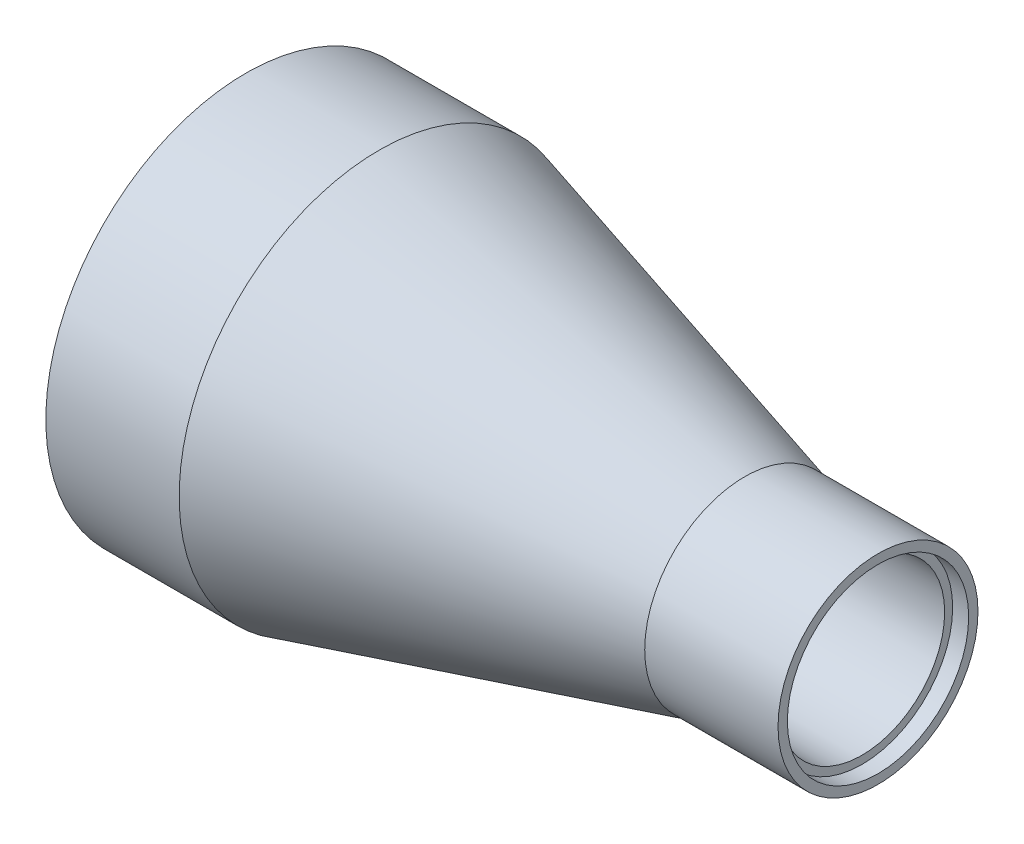
ISO-10303-21;
HEADER;
FILE_DESCRIPTION(('STEP AP214'),'2;1');
FILE_NAME('part.step','',(''),(''),'','','');
FILE_SCHEMA(('AUTOMOTIVE_DESIGN { 1 0 10303 214 1 1 1 1 }'));
ENDSEC;
DATA;
#1=APPLICATION_CONTEXT('core data for automotive mechanical design processes');
#2=APPLICATION_PROTOCOL_DEFINITION('international standard','automotive_design',2000,#1);
#3=PRODUCT_CONTEXT('',#1,'mechanical');
#4=PRODUCT('Part','Part','',(#3));
#5=PRODUCT_RELATED_PRODUCT_CATEGORY('part','',(#4));
#6=PRODUCT_DEFINITION_FORMATION('','',#4);
#7=PRODUCT_DEFINITION_CONTEXT('part definition',#1,'design');
#8=PRODUCT_DEFINITION('design','',#6,#7);
#9=PRODUCT_DEFINITION_SHAPE('','',#8);
#10=(LENGTH_UNIT() NAMED_UNIT(*) SI_UNIT(.MILLI.,.METRE.));
#11=(NAMED_UNIT(*) PLANE_ANGLE_UNIT() SI_UNIT($,.RADIAN.));
#12=(NAMED_UNIT(*) SI_UNIT($,.STERADIAN.) SOLID_ANGLE_UNIT());
#13=UNCERTAINTY_MEASURE_WITH_UNIT(LENGTH_MEASURE(1.E-05),#10,'distance_accuracy_value','');
#14=(GEOMETRIC_REPRESENTATION_CONTEXT(3) GLOBAL_UNCERTAINTY_ASSIGNED_CONTEXT((#13)) GLOBAL_UNIT_ASSIGNED_CONTEXT((#10,
#11,#12)) REPRESENTATION_CONTEXT('',''));
#15=CARTESIAN_POINT('',(0.,0.,0.));
#16=DIRECTION('',(0.,0.,1.));
#17=DIRECTION('',(1.,0.,0.));
#18=AXIS2_PLACEMENT_3D('',#15,#16,#17);
#19=CARTESIAN_POINT('',(0.,0.,0.));
#20=DIRECTION('',(1.,0.,0.));
#21=DIRECTION('',(0.,0.,-1.));
#22=AXIS2_PLACEMENT_3D('',#19,#20,#21);
#23=CYLINDRICAL_SURFACE('',#22,17.399);
#24=CARTESIAN_POINT('',(12.4782789957329,0.,0.));
#25=DIRECTION('',(1.,0.,0.));
#26=DIRECTION('',(0.,0.,-1.));
#27=AXIS2_PLACEMENT_3D('',#24,#25,#26);
#28=CIRCLE('',#27,17.399);
#29=CARTESIAN_POINT('',(12.4782789957329,0.,-17.399));
#30=VERTEX_POINT('',#29);
#31=EDGE_CURVE('E12',#30,#30,#28,.T.);
#32=ORIENTED_EDGE('',*,*,#31,.T.);
#33=EDGE_LOOP('',(#32));
#34=FACE_BOUND('',#33,.T.);
#35=CARTESIAN_POINT('',(0.,0.,0.));
#36=DIRECTION('',(1.,0.,0.));
#37=DIRECTION('',(0.,0.,-1.));
#38=AXIS2_PLACEMENT_3D('',#35,#36,#37);
#39=CIRCLE('',#38,17.399);
#40=CARTESIAN_POINT('',(0.,0.,-17.399));
#41=VERTEX_POINT('',#40);
#42=EDGE_CURVE('E80',#41,#41,#39,.T.);
#43=ORIENTED_EDGE('',*,*,#42,.F.);
#44=EDGE_LOOP('',(#43));
#45=FACE_BOUND('',#44,.T.);
#46=ADVANCED_FACE('F46',(#34,#45),#23,.F.);
#47=CARTESIAN_POINT('',(12.4782789957329,0.,0.));
#48=DIRECTION('',(-1.,0.,0.));
#49=DIRECTION('',(0.,0.,1.));
#50=AXIS2_PLACEMENT_3D('',#47,#48,#49);
#51=CONICAL_SURFACE('',#50,17.399,0.266992515356942);
#52=CARTESIAN_POINT('',(47.3016789971863,0.,0.));
#53=DIRECTION('',(1.,0.,0.));
#54=DIRECTION('',(0.,0.,-1.));
#55=AXIS2_PLACEMENT_3D('',#52,#53,#54);
#56=CIRCLE('',#55,7.87400000531202);
#57=CARTESIAN_POINT('',(47.3016789971863,0.,-7.87400000531202));
#58=VERTEX_POINT('',#57);
#59=EDGE_CURVE('E52',#58,#58,#56,.T.);
#60=ORIENTED_EDGE('',*,*,#59,.T.);
#61=EDGE_LOOP('',(#60));
#62=FACE_BOUND('',#61,.T.);
#63=ORIENTED_EDGE('',*,*,#31,.F.);
#64=EDGE_LOOP('',(#63));
#65=FACE_BOUND('',#64,.T.);
#66=ADVANCED_FACE('F88',(#62,#65),#51,.F.);
#67=CARTESIAN_POINT('',(0.,0.,0.));
#68=DIRECTION('',(1.,0.,0.));
#69=DIRECTION('',(0.,0.,-1.));
#70=AXIS2_PLACEMENT_3D('',#67,#68,#69);
#71=CYLINDRICAL_SURFACE('',#70,7.87400000531202);
#72=CARTESIAN_POINT('',(58.6994000000003,0.,0.));
#73=DIRECTION('',(1.,0.,0.));
#74=DIRECTION('',(0.,0.,-1.));
#75=AXIS2_PLACEMENT_3D('',#72,#73,#74);
#76=CIRCLE('',#75,7.87400000531202);
#77=CARTESIAN_POINT('',(58.6994000000003,0.,-7.87400000531202));
#78=VERTEX_POINT('',#77);
#79=EDGE_CURVE('E56',#78,#78,#76,.T.);
#80=ORIENTED_EDGE('',*,*,#79,.T.);
#81=EDGE_LOOP('',(#80));
#82=FACE_BOUND('',#81,.T.);
#83=ORIENTED_EDGE('',*,*,#59,.F.);
#84=EDGE_LOOP('',(#83));
#85=FACE_BOUND('',#84,.T.);
#86=ADVANCED_FACE('F93',(#82,#85),#71,.F.);
#87=CARTESIAN_POINT('',(58.6994000000003,7.87400000531202,0.));
#88=DIRECTION('',(1.,0.,0.));
#89=DIRECTION('',(0.,0.,-1.));
#90=AXIS2_PLACEMENT_3D('',#87,#88,#89);
#91=PLANE('',#90);
#92=CARTESIAN_POINT('',(58.6994000000003,0.,0.));
#93=DIRECTION('',(1.,0.,0.));
#94=DIRECTION('',(0.,0.,-1.));
#95=AXIS2_PLACEMENT_3D('',#92,#93,#94);
#96=CIRCLE('',#95,8.636000005312);
#97=CARTESIAN_POINT('',(58.6994000000003,0.,-8.636000005312));
#98=VERTEX_POINT('',#97);
#99=EDGE_CURVE('E60',#98,#98,#96,.T.);
#100=ORIENTED_EDGE('',*,*,#99,.T.);
#101=EDGE_LOOP('',(#100));
#102=FACE_BOUND('',#101,.T.);
#103=ORIENTED_EDGE('',*,*,#79,.F.);
#104=EDGE_LOOP('',(#103));
#105=FACE_BOUND('',#104,.T.);
#106=ADVANCED_FACE('F98',(#102,#105),#91,.T.);
#107=CARTESIAN_POINT('',(0.,0.,0.));
#108=DIRECTION('',(1.,0.,0.));
#109=DIRECTION('',(0.,0.,-1.));
#110=AXIS2_PLACEMENT_3D('',#107,#108,#109);
#111=CYLINDRICAL_SURFACE('',#110,8.636000005312);
#112=CARTESIAN_POINT('',(60.2234000000005,0.,0.));
#113=DIRECTION('',(1.,0.,0.));
#114=DIRECTION('',(0.,0.,-1.));
#115=AXIS2_PLACEMENT_3D('',#112,#113,#114);
#116=CIRCLE('',#115,8.636000005312);
#117=CARTESIAN_POINT('',(60.2234000000005,0.,-8.636000005312));
#118=VERTEX_POINT('',#117);
#119=EDGE_CURVE('E65',#118,#118,#116,.T.);
#120=ORIENTED_EDGE('',*,*,#119,.T.);
#121=EDGE_LOOP('',(#120));
#122=FACE_BOUND('',#121,.T.);
#123=ORIENTED_EDGE('',*,*,#99,.F.);
#124=EDGE_LOOP('',(#123));
#125=FACE_BOUND('',#124,.T.);
#126=ADVANCED_FACE('F105',(#122,#125),#111,.F.);
#127=CARTESIAN_POINT('',(60.2234000000005,8.636000005312,0.));
#128=DIRECTION('',(1.,0.,0.));
#129=DIRECTION('',(0.,0.,-1.));
#130=AXIS2_PLACEMENT_3D('',#127,#128,#129);
#131=PLANE('',#130);
#132=CARTESIAN_POINT('',(60.2234000000005,0.,0.));
#133=DIRECTION('',(1.,0.,0.));
#134=DIRECTION('',(0.,0.,-1.));
#135=AXIS2_PLACEMENT_3D('',#132,#133,#134);
#136=CIRCLE('',#135,9.52500001062405);
#137=CARTESIAN_POINT('',(60.2234000000005,0.,-9.52500001062405));
#138=VERTEX_POINT('',#137);
#139=EDGE_CURVE('E68',#138,#138,#136,.T.);
#140=ORIENTED_EDGE('',*,*,#139,.T.);
#141=EDGE_LOOP('',(#140));
#142=FACE_BOUND('',#141,.T.);
#143=ORIENTED_EDGE('',*,*,#119,.F.);
#144=EDGE_LOOP('',(#143));
#145=FACE_BOUND('',#144,.T.);
#146=ADVANCED_FACE('F109',(#142,#145),#131,.T.);
#147=CARTESIAN_POINT('',(0.,0.,0.));
#148=DIRECTION('',(1.,0.,0.));
#149=DIRECTION('',(0.,0.,-1.));
#150=AXIS2_PLACEMENT_3D('',#147,#148,#149);
#151=CYLINDRICAL_SURFACE('',#150,9.52500001062405);
#152=CARTESIAN_POINT('',(47.5234000014534,0.,0.));
#153=DIRECTION('',(1.,0.,0.));
#154=DIRECTION('',(0.,0.,-1.));
#155=AXIS2_PLACEMENT_3D('',#152,#153,#154);
#156=CIRCLE('',#155,9.52500001062405);
#157=CARTESIAN_POINT('',(47.5234000014534,0.,-9.52500001062405));
#158=VERTEX_POINT('',#157);
#159=EDGE_CURVE('E71',#158,#158,#156,.T.);
#160=ORIENTED_EDGE('',*,*,#159,.T.);
#161=EDGE_LOOP('',(#160));
#162=FACE_BOUND('',#161,.T.);
#163=ORIENTED_EDGE('',*,*,#139,.F.);
#164=EDGE_LOOP('',(#163));
#165=FACE_BOUND('',#164,.T.);
#166=ADVANCED_FACE('F113',(#162,#165),#151,.T.);
#167=CARTESIAN_POINT('',(47.5234000014534,0.,0.));
#168=DIRECTION('',(-1.,0.,0.));
#169=DIRECTION('',(0.,0.,1.));
#170=AXIS2_PLACEMENT_3D('',#167,#168,#169);
#171=CONICAL_SURFACE('',#170,9.52500001062405,0.2669925152044);
#172=CARTESIAN_POINT('',(12.699999998547,0.,0.));
#173=DIRECTION('',(1.,0.,0.));
#174=DIRECTION('',(0.,0.,-1.));
#175=AXIS2_PLACEMENT_3D('',#172,#173,#174);
#176=CIRCLE('',#175,19.05);
#177=CARTESIAN_POINT('',(12.699999998547,0.,-19.05));
#178=VERTEX_POINT('',#177);
#179=EDGE_CURVE('E74',#178,#178,#176,.T.);
#180=ORIENTED_EDGE('',*,*,#179,.T.);
#181=EDGE_LOOP('',(#180));
#182=FACE_BOUND('',#181,.T.);
#183=ORIENTED_EDGE('',*,*,#159,.F.);
#184=EDGE_LOOP('',(#183));
#185=FACE_BOUND('',#184,.T.);
#186=ADVANCED_FACE('F117',(#182,#185),#171,.T.);
#187=CARTESIAN_POINT('',(0.,0.,0.));
#188=DIRECTION('',(1.,0.,0.));
#189=DIRECTION('',(0.,0.,-1.));
#190=AXIS2_PLACEMENT_3D('',#187,#188,#189);
#191=CYLINDRICAL_SURFACE('',#190,19.05);
#192=CARTESIAN_POINT('',(0.,0.,0.));
#193=DIRECTION('',(1.,0.,0.));
#194=DIRECTION('',(0.,0.,-1.));
#195=AXIS2_PLACEMENT_3D('',#192,#193,#194);
#196=CIRCLE('',#195,19.05);
#197=CARTESIAN_POINT('',(0.,0.,-19.05));
#198=VERTEX_POINT('',#197);
#199=EDGE_CURVE('E77',#198,#198,#196,.T.);
#200=ORIENTED_EDGE('',*,*,#199,.T.);
#201=EDGE_LOOP('',(#200));
#202=FACE_BOUND('',#201,.T.);
#203=ORIENTED_EDGE('',*,*,#179,.F.);
#204=EDGE_LOOP('',(#203));
#205=FACE_BOUND('',#204,.T.);
#206=ADVANCED_FACE('F121',(#202,#205),#191,.T.);
#207=CARTESIAN_POINT('',(0.,19.05,0.));
#208=DIRECTION('',(-1.,0.,0.));
#209=DIRECTION('',(0.,0.,1.));
#210=AXIS2_PLACEMENT_3D('',#207,#208,#209);
#211=PLANE('',#210);
#212=ORIENTED_EDGE('',*,*,#42,.T.);
#213=EDGE_LOOP('',(#212));
#214=FACE_BOUND('',#213,.T.);
#215=ORIENTED_EDGE('',*,*,#199,.F.);
#216=EDGE_LOOP('',(#215));
#217=FACE_BOUND('',#216,.T.);
#218=ADVANCED_FACE('F84',(#214,#217),#211,.T.);
#219=CLOSED_SHELL('',(#46,#66,#86,#106,#126,#146,#166,#186,#206,#218));
#220=MANIFOLD_SOLID_BREP('B2',#219);
#221=CARTESIAN_POINT('',(12.4782789957329,0.,0.));
#222=DIRECTION('',(-1.,0.,0.));
#223=DIRECTION('',(0.,0.,1.));
#224=AXIS2_PLACEMENT_3D('',#221,#222,#223);
#225=CONICAL_SURFACE('',#224,17.399,0.266992515356942);
#226=CARTESIAN_POINT('',(12.4782789957329,0.,0.));
#227=DIRECTION('',(1.,0.,0.));
#228=DIRECTION('',(0.,0.,-1.));
#229=AXIS2_PLACEMENT_3D('',#226,#227,#228);
#230=CIRCLE('',#229,17.399);
#231=CARTESIAN_POINT('',(12.4782789957329,15.5153254880457,7.874));
#232=VERTEX_POINT('',#231);
#233=CARTESIAN_POINT('',(12.4782789957329,-15.5153254880457,7.874));
#234=VERTEX_POINT('',#233);
#235=EDGE_CURVE('E208',#232,#234,#230,.T.);
#236=ORIENTED_EDGE('',*,*,#235,.T.);
#237=CARTESIAN_POINT('',(-7.27802277379637,-21.4001851295684,7.874));
#238=CARTESIAN_POINT('',(-6.25910380706465,-21.1032144771014,7.874));
#239=CARTESIAN_POINT('',(-5.24037920643223,-20.8055759838306,7.874));
#240=CARTESIAN_POINT('',(-3.2033809480195,-20.2087541049411,7.874));
#241=CARTESIAN_POINT('',(-2.18510729095694,-19.9095707168731,7.874));
#242=CARTESIAN_POINT('',(-0.148760269933987,-19.3093576099847,7.874));
#243=CARTESIAN_POINT('',(0.869312933664238,-19.0083273467247,7.874));
#244=CARTESIAN_POINT('',(2.90485739112217,-18.4042424985256,7.874));
#245=CARTESIAN_POINT('',(3.92232864537925,-18.1011879149244,7.874));
#246=CARTESIAN_POINT('',(6.97940213930874,-17.1868412884916,7.874));
#247=CARTESIAN_POINT('',(9.01796012924298,-16.5720440520045,7.874));
#248=CARTESIAN_POINT('',(12.072559979437,-15.6402687364783,7.874));
#249=CARTESIAN_POINT('',(13.0900769819165,-15.3281251322482,7.874));
#250=CARTESIAN_POINT('',(15.1239120844535,-14.6999675363233,7.874));
#251=CARTESIAN_POINT('',(16.1402301896535,-14.3839535612966,7.874));
#252=CARTESIAN_POINT('',(18.1710030574593,-13.7473770211093,7.874));
#253=CARTESIAN_POINT('',(19.1854583959214,-13.4268162947515,7.874));
#254=CARTESIAN_POINT('',(21.2125387204064,-12.7799603468666,7.874));
#255=CARTESIAN_POINT('',(22.225163711922,-12.4536651425796,7.874));
#256=CARTESIAN_POINT('',(24.2489569167502,-11.7936107943099,7.874));
#257=CARTESIAN_POINT('',(25.2601230937277,-11.4598453983557,7.874));
#258=CARTESIAN_POINT('',(27.2793321516114,-10.7831467220063,7.874));
#259=CARTESIAN_POINT('',(28.2873752062071,-10.4402139620423,7.874));
#260=CARTESIAN_POINT('',(29.7966919868314,-9.916563694888,7.874));
#261=CARTESIAN_POINT('',(30.2995452313092,-9.74039761921109,7.874));
#262=CARTESIAN_POINT('',(31.3039897362006,-9.38450675825581,7.874));
#263=CARTESIAN_POINT('',(31.8055810032149,-9.20478199163492,7.874));
#264=CARTESIAN_POINT('',(32.8073681189904,-8.84110544173149,7.874));
#265=CARTESIAN_POINT('',(33.3075636012053,-8.65715264735136,7.874));
#266=CARTESIAN_POINT('',(34.3060898541446,-8.28426032590797,7.874));
#267=CARTESIAN_POINT('',(34.8044206448752,-8.09532085252276,7.874));
#268=CARTESIAN_POINT('',(35.7979632655609,-7.71171356297616,7.874));
#269=CARTESIAN_POINT('',(36.2931788057742,-7.51705537778416,7.874));
#270=CARTESIAN_POINT('',(37.2806334976161,-7.12033663358451,7.874));
#271=CARTESIAN_POINT('',(37.7728727200106,-6.91827625138632,7.874));
#272=CARTESIAN_POINT('',(38.7532374741106,-6.50490579247054,7.874));
#273=CARTESIAN_POINT('',(39.2413645317171,-6.29359934486682,7.874));
#274=CARTESIAN_POINT('',(40.212215900844,-5.85895967009432,7.874));
#275=CARTESIAN_POINT('',(40.6949408998076,-5.63562799471852,7.874));
#276=CARTESIAN_POINT('',(41.3659567130019,-5.31126201948325,7.874));
#277=CARTESIAN_POINT('',(41.5575428587763,-5.21703594442742,7.874));
#278=CARTESIAN_POINT('',(41.9392131847358,-5.02556829622259,7.874));
#279=CARTESIAN_POINT('',(42.129297321563,-4.92832663642027,7.874));
#280=CARTESIAN_POINT('',(42.5078355056852,-4.73028924443581,7.874));
#281=CARTESIAN_POINT('',(42.6962878613926,-4.62949027203751,7.874));
#282=CARTESIAN_POINT('',(43.0709783085765,-4.42385985659745,7.874));
#283=CARTESIAN_POINT('',(43.2572164706834,-4.31902854263711,7.874));
#284=CARTESIAN_POINT('',(43.626175959625,-4.10506656505181,7.874));
#285=CARTESIAN_POINT('',(43.8089087352559,-3.99595571084024,7.874));
#286=CARTESIAN_POINT('',(44.1709083287937,-3.77213486830168,7.874));
#287=CARTESIAN_POINT('',(44.3501754451234,-3.65742536509116,7.874));
#288=CARTESIAN_POINT('',(44.7039756367729,-3.42138632310818,7.874));
#289=CARTESIAN_POINT('',(44.8785146688025,-3.30006575536956,7.874));
#290=CARTESIAN_POINT('',(45.221521981723,-3.04917112639553,7.874));
#291=CARTESIAN_POINT('',(45.3899926837546,-2.91960041521092,7.874));
#292=CARTESIAN_POINT('',(45.6587501004487,-2.69912313524123,7.874));
#293=CARTESIAN_POINT('',(45.7615539929415,-2.61129007458912,7.874));
#294=CARTESIAN_POINT('',(45.9628471627579,-2.43072952441601,7.874));
#295=CARTESIAN_POINT('',(46.061335327137,-2.33800078582769,7.874));
#296=CARTESIAN_POINT('',(46.2525759587667,-2.14702485821345,7.874));
#297=CARTESIAN_POINT('',(46.3453364236747,-2.04878574702081,7.874));
#298=CARTESIAN_POINT('',(46.5234495797422,-1.84585514178639,7.874));
#299=CARTESIAN_POINT('',(46.6088065380468,-1.74116742483014,7.874));
#300=CARTESIAN_POINT('',(46.7840900838978,-1.50505588933542,7.874));
#301=CARTESIAN_POINT('',(46.8721185304147,-1.37219286612227,7.874));
#302=CARTESIAN_POINT('',(47.0287388442007,-1.09537285415362,7.874));
#303=CARTESIAN_POINT('',(47.0973601353484,-0.951433085376207,7.874));
#304=CARTESIAN_POINT('',(47.1972803356967,-0.681817252237787,7.874));
#305=CARTESIAN_POINT('',(47.2331994421036,-0.557887419595219,7.874));
#306=CARTESIAN_POINT('',(47.2836397134011,-0.305773361123949,7.874));
#307=CARTESIAN_POINT('',(47.2981900133268,-0.177595172107852,7.874));
#308=CARTESIAN_POINT('',(47.3040549640661,0.0796717132573063,7.874));
#309=CARTESIAN_POINT('',(47.2953046055285,0.208761952743628,7.874));
#310=CARTESIAN_POINT('',(47.2556164372325,0.463506041219542,7.874));
#311=CARTESIAN_POINT('',(47.2246520935782,0.589155593906442,7.874));
#312=CARTESIAN_POINT('',(47.1309268070996,0.873978768279881,7.874));
#313=CARTESIAN_POINT('',(47.061105472704,1.0307879046161,7.874));
#314=CARTESIAN_POINT('',(46.8980176996286,1.33163831964191,7.874));
#315=CARTESIAN_POINT('',(46.8046924049963,1.47564629970866,7.874));
#316=CARTESIAN_POINT('',(46.607587658298,1.74416555295985,7.874));
#317=CARTESIAN_POINT('',(46.5046536262231,1.86931137402846,7.874));
#318=CARTESIAN_POINT('',(46.2885703112658,2.11054095182051,7.874));
#319=CARTESIAN_POINT('',(46.1754109150314,2.22661552037062,7.874));
#320=CARTESIAN_POINT('',(45.9414305711894,2.45137584584022,7.874));
#321=CARTESIAN_POINT('',(45.8205886397567,2.56003952431494,7.874));
#322=CARTESIAN_POINT('',(45.5734803933225,2.77083248661495,7.874));
#323=CARTESIAN_POINT('',(45.4472168344246,2.87296502634716,7.874));
#324=CARTESIAN_POINT('',(45.1940923240746,3.06900531726234,7.874));
#325=CARTESIAN_POINT('',(45.0673470162842,3.16306326643575,7.874));
#326=CARTESIAN_POINT('',(44.8107147504699,3.34680275889356,7.874));
#327=CARTESIAN_POINT('',(44.6808274082273,3.43648376286285,7.874));
#328=CARTESIAN_POINT('',(44.2872656866168,3.70000805685495,7.874));
#329=CARTESIAN_POINT('',(44.0198272478085,3.86823014889126,7.874));
#330=CARTESIAN_POINT('',(43.4776160533581,4.19367416082606,7.874));
#331=CARTESIAN_POINT('',(43.2028281634334,4.35087050560174,7.874));
#332=CARTESIAN_POINT('',(42.6483218709485,4.65635544164448,7.874));
#333=CARTESIAN_POINT('',(42.368602866787,4.80464293615737,7.874));
#334=CARTESIAN_POINT('',(41.8040252371264,5.09481891265031,7.874));
#335=CARTESIAN_POINT('',(41.5191473293013,5.2366696798619,7.874));
#336=CARTESIAN_POINT('',(40.9465106670164,5.51446167912127,7.874));
#337=CARTESIAN_POINT('',(40.6587517216391,5.65040251630409,7.874));
#338=CARTESIAN_POINT('',(40.0814139919198,5.91714913619959,7.874));
#339=CARTESIAN_POINT('',(39.7918387445654,6.04796259486862,7.874));
#340=CARTESIAN_POINT('',(39.2108602141868,6.30542855794907,7.874));
#341=CARTESIAN_POINT('',(38.9194569900037,6.43208119548382,7.874));
#342=CARTESIAN_POINT('',(38.0509755001705,6.80331871158334,7.874));
#343=CARTESIAN_POINT('',(37.4717120992266,7.04279307694072,7.874));
#344=CARTESIAN_POINT('',(36.3089871457577,7.51135209149482,7.874));
#345=CARTESIAN_POINT('',(35.7255253388763,7.74043610495547,7.874));
#346=CARTESIAN_POINT('',(34.5553549169691,8.19048940972633,7.874));
#347=CARTESIAN_POINT('',(33.9686456817095,8.41145708468816,7.874));
#348=CARTESIAN_POINT('',(32.7928020696881,8.8468468904412,7.874));
#349=CARTESIAN_POINT('',(32.2036676633039,9.06126894100972,7.874));
#350=CARTESIAN_POINT('',(31.0227644067721,9.48501069928943,7.874));
#351=CARTESIAN_POINT('',(30.430993230012,9.69432391231006,7.874));
#352=CARTESIAN_POINT('',(29.2458870267365,10.1084769156017,7.874));
#353=CARTESIAN_POINT('',(28.6525519924633,10.3133166836346,7.874));
#354=CARTESIAN_POINT('',(26.8707721790911,10.9221655588335,7.874));
#355=CARTESIAN_POINT('',(25.6804073925674,11.3205559422207,7.874));
#356=CARTESIAN_POINT('',(23.3017246884279,12.1044984958523,7.874));
#357=CARTESIAN_POINT('',(22.1134237868772,12.4901025424264,7.874));
#358=CARTESIAN_POINT('',(19.7341266494345,13.2530068756828,7.874));
#359=CARTESIAN_POINT('',(18.5431303394616,13.6303069310038,7.874));
#360=CARTESIAN_POINT('',(16.1598313325445,14.3781663229512,7.874));
#361=CARTESIAN_POINT('',(14.9675298896161,14.7487296626945,7.874));
#362=CARTESIAN_POINT('',(12.5813328444659,15.4846405356389,7.874));
#363=CARTESIAN_POINT('',(11.3874372577572,15.8499881191975,7.874));
#364=CARTESIAN_POINT('',(8.43015758082235,16.7492252446992,7.874));
#365=CARTESIAN_POINT('',(6.66601572293668,17.280621615046,7.874));
#366=CARTESIAN_POINT('',(3.13564155402863,18.3364301565588,7.874));
#367=CARTESIAN_POINT('',(1.3694092371799,18.8608423082089,7.874));
#368=CARTESIAN_POINT('',(-2.16468574884552,19.9042179272702,7.874));
#369=CARTESIAN_POINT('',(-3.9325484371947,20.4231813296942,7.874));
#370=CARTESIAN_POINT('',(-7.46954311415902,21.4567652394556,7.874));
#371=CARTESIAN_POINT('',(-9.23867510352628,21.9713857442175,7.874));
#372=CARTESIAN_POINT('',(-12.7785076871016,22.9972664208036,7.874));
#373=CARTESIAN_POINT('',(-14.5492085976993,23.5085255004089,7.874));
#374=CARTESIAN_POINT('',(-18.0914455715526,24.5281424130168,7.874));
#375=CARTESIAN_POINT('',(-19.8629816349927,25.036500245378,7.874));
#376=CARTESIAN_POINT('',(-25.1785966379557,26.5579666441515,7.874));
#377=CARTESIAN_POINT('',(-28.7237060253707,27.5674749466062,7.874));
#378=CARTESIAN_POINT('',(-35.8312836616897,29.5840129892654,7.874));
#379=CARTESIAN_POINT('',(-39.3937603714243,30.5910128721368,7.874));
#380=CARTESIAN_POINT('',(-46.5201721143257,32.5998663900025,7.874));
#381=CARTESIAN_POINT('',(-50.0841071505669,33.6017200140864,7.874));
#382=CARTESIAN_POINT('',(-57.2117181147282,35.6011308372712,7.874));
#383=CARTESIAN_POINT('',(-60.775393624758,36.598689526824,7.874));
#384=CARTESIAN_POINT('',(-67.9036019397533,38.5906985103654,7.874));
#385=CARTESIAN_POINT('',(-71.4681347421241,39.5851488136372,7.874));
#386=CARTESIAN_POINT('',(-75.0329869626662,40.5784500957166,7.874));
#387=B_SPLINE_CURVE_WITH_KNOTS('',3,(#237,#238,#239,#240,#241,#242,#243,#244,#245,#246,#247,
#248,#249,#250,#251,#252,#253,#254,#255,#256,#257,#258,#259,#260,#261,#262,#263,#264,#265,#266,
#267,#268,#269,#270,#271,#272,#273,#274,#275,#276,#277,#278,#279,#280,#281,#282,#283,#284,#285,
#286,#287,#288,#289,#290,#291,#292,#293,#294,#295,#296,#297,#298,#299,#300,#301,#302,#303,#304,
#305,#306,#307,#308,#309,#310,#311,#312,#313,#314,#315,#316,#317,#318,#319,#320,#321,#322,#323,
#324,#325,#326,#327,#328,#329,#330,#331,#332,#333,#334,#335,#336,#337,#338,#339,#340,#341,#342,
#343,#344,#345,#346,#347,#348,#349,#350,#351,#352,#353,#354,#355,#356,#357,#358,#359,#360,#361,
#362,#363,#364,#365,#366,#367,#368,#369,#370,#371,#372,#373,#374,#375,#376,#377,#378,#379,#380,
#381,#382,#383,#384,#385,#386),.UNSPECIFIED.,.F.,.F.,(4,2,2,2,2,2,2,2,2,2,2,2,2,2,2,2,2,2,2,2,2,
2,2,2,2,2,2,2,2,2,2,2,2,2,2,2,2,2,2,2,2,2,2,2,2,2,2,2,2,2,2,2,2,2,2,2,2,2,2,2,2,2,2,2,2,2,2,2,2,
2,2,2,2,2,4),(0.,3.18394216264859,6.36788937493283,9.55282519956095,12.7377589192857,
19.1254630089899,22.3184136165859,25.511350478161,28.7030309189595,31.8947017659981,
35.0891518274887,38.2834209236365,39.8818668137399,41.4803043257329,43.0791281518772,
44.6779347748344,46.2741878680207,47.8704028578096,49.4659968509518,51.0613854321832,
51.7018756991635,52.3423843878226,52.9834923641957,53.6245798347749,54.2629867574632,
54.9013384607968,55.5388445233076,56.1760933510764,56.5816167188701,56.9872440553286,
57.3922915671503,57.7971040492738,58.2740841466253,58.7503371525015,59.1358397838278,
59.5208163168131,59.9068680674378,60.2933817139633,60.8054164947508,61.3187464299104,
61.8041379991974,62.2900150102571,62.7772814485553,63.2643030497363,63.7376927441918,
64.2111406219134,65.1585455161321,66.1080799045618,67.0577309501079,68.0123715758737,
68.9670758870996,69.9202916505563,70.8734768866102,72.7537616399725,74.6341612842187,
76.5149333970967,78.3957285513326,80.2788017830622,82.1618843736466,85.9275869249939,
89.6754508185402,93.4234190011644,97.169082016656,100.914708843671,106.442002682223,
111.969311962428,117.496687092162,123.024065499851,128.553158988202,134.082253698981,
145.140369310247,156.246561369417,167.352776964511,178.454764410773,189.55671866955),.UNSPECIFIED.);
#388=EDGE_CURVE('E227',#232,#234,#387,.F.);
#389=ORIENTED_EDGE('',*,*,#388,.F.);
#390=EDGE_LOOP('',(#236,#389));
#391=FACE_BOUND('',#390,.T.);
#392=ADVANCED_FACE('F198',(#391),#225,.T.);
#393=CARTESIAN_POINT('',(0.,0.,0.));
#394=DIRECTION('',(1.,0.,0.));
#395=DIRECTION('',(0.,0.,-1.));
#396=AXIS2_PLACEMENT_3D('',#393,#394,#395);
#397=CYLINDRICAL_SURFACE('',#396,17.399);
#398=CARTESIAN_POINT('',(0.,0.,0.));
#399=DIRECTION('',(1.,0.,0.));
#400=DIRECTION('',(0.,0.,-1.));
#401=AXIS2_PLACEMENT_3D('',#398,#399,#400);
#402=CIRCLE('',#401,17.399);
#403=CARTESIAN_POINT('',(0.,15.5153254880457,7.874));
#404=VERTEX_POINT('',#403);
#405=CARTESIAN_POINT('',(0.,-15.5153254880457,7.874));
#406=VERTEX_POINT('',#405);
#407=EDGE_CURVE('E44',#404,#406,#402,.T.);
#408=ORIENTED_EDGE('',*,*,#407,.T.);
#409=DIRECTION('',(1.,0.,0.));
#410=VECTOR('',#409,1.);
#411=CARTESIAN_POINT('',(0.,-15.5153254880457,7.874));
#412=LINE('',#411,#410);
#413=EDGE_CURVE('E222',#234,#406,#412,.F.);
#414=ORIENTED_EDGE('',*,*,#413,.F.);
#415=ORIENTED_EDGE('',*,*,#235,.F.);
#416=DIRECTION('',(1.,0.,0.));
#417=VECTOR('',#416,1.);
#418=CARTESIAN_POINT('',(0.,15.5153254880457,7.874));
#419=LINE('',#418,#417);
#420=EDGE_CURVE('E203',#404,#232,#419,.T.);
#421=ORIENTED_EDGE('',*,*,#420,.F.);
#422=EDGE_LOOP('',(#408,#414,#415,#421));
#423=FACE_BOUND('',#422,.T.);
#424=ADVANCED_FACE('F233',(#423),#397,.T.);
#425=CARTESIAN_POINT('',(0.,0.,0.));
#426=DIRECTION('',(-1.,0.,0.));
#427=DIRECTION('',(0.,0.,1.));
#428=AXIS2_PLACEMENT_3D('',#425,#426,#427);
#429=PLANE('',#428);
#430=ORIENTED_EDGE('',*,*,#407,.F.);
#431=DIRECTION('',(0.,-1.,0.));
#432=VECTOR('',#431,1.);
#433=CARTESIAN_POINT('',(0.,0.,7.874));
#434=LINE('',#433,#432);
#435=EDGE_CURVE('E230',#404,#406,#434,.T.);
#436=ORIENTED_EDGE('',*,*,#435,.T.);
#437=EDGE_LOOP('',(#430,#436));
#438=FACE_BOUND('',#437,.T.);
#439=ADVANCED_FACE('F244',(#438),#429,.T.);
#440=CARTESIAN_POINT('',(0.,0.,7.874));
#441=DIRECTION('',(0.,0.,-1.));
#442=DIRECTION('',(-1.,0.,0.));
#443=AXIS2_PLACEMENT_3D('',#440,#441,#442);
#444=PLANE('',#443);
#445=ORIENTED_EDGE('',*,*,#435,.F.);
#446=ORIENTED_EDGE('',*,*,#420,.T.);
#447=ORIENTED_EDGE('',*,*,#388,.T.);
#448=ORIENTED_EDGE('',*,*,#413,.T.);
#449=EDGE_LOOP('',(#445,#446,#447,#448));
#450=FACE_BOUND('',#449,.T.);
#451=ADVANCED_FACE('F200',(#450),#444,.T.);
#452=CLOSED_SHELL('',(#392,#424,#439,#451));
#453=MANIFOLD_SOLID_BREP('B7',#452);
#454=ADVANCED_BREP_SHAPE_REPRESENTATION('',(#18,#220,#453),#14);
#455=SHAPE_DEFINITION_REPRESENTATION(#9,#454);
ENDSEC;
END-ISO-10303-21;
